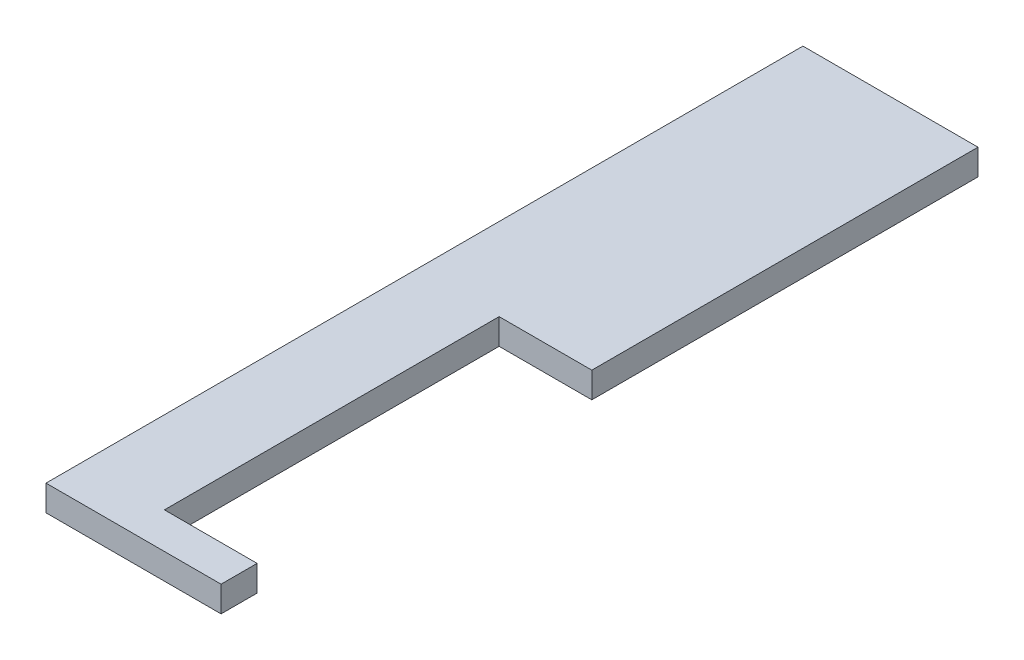
ISO-10303-21;
HEADER;
FILE_DESCRIPTION(('STEP AP214'),'2;1');
FILE_NAME('part.step','',(''),(''),'','','');
FILE_SCHEMA(('AUTOMOTIVE_DESIGN { 1 0 10303 214 1 1 1 1 }'));
ENDSEC;
DATA;
#1=APPLICATION_CONTEXT('core data for automotive mechanical design processes');
#2=APPLICATION_PROTOCOL_DEFINITION('international standard','automotive_design',2000,#1);
#3=PRODUCT_CONTEXT('',#1,'mechanical');
#4=PRODUCT('Part','Part','',(#3));
#5=PRODUCT_RELATED_PRODUCT_CATEGORY('part','',(#4));
#6=PRODUCT_DEFINITION_FORMATION('','',#4);
#7=PRODUCT_DEFINITION_CONTEXT('part definition',#1,'design');
#8=PRODUCT_DEFINITION('design','',#6,#7);
#9=PRODUCT_DEFINITION_SHAPE('','',#8);
#10=(LENGTH_UNIT() NAMED_UNIT(*) SI_UNIT(.MILLI.,.METRE.));
#11=(NAMED_UNIT(*) PLANE_ANGLE_UNIT() SI_UNIT($,.RADIAN.));
#12=(NAMED_UNIT(*) SI_UNIT($,.STERADIAN.) SOLID_ANGLE_UNIT());
#13=UNCERTAINTY_MEASURE_WITH_UNIT(LENGTH_MEASURE(1.E-05),#10,'distance_accuracy_value','');
#14=(GEOMETRIC_REPRESENTATION_CONTEXT(3) GLOBAL_UNCERTAINTY_ASSIGNED_CONTEXT((#13)) GLOBAL_UNIT_ASSIGNED_CONTEXT((#10,
#11,#12)) REPRESENTATION_CONTEXT('',''));
#15=CARTESIAN_POINT('',(0.,0.,0.));
#16=DIRECTION('',(0.,0.,1.));
#17=DIRECTION('',(1.,0.,0.));
#18=AXIS2_PLACEMENT_3D('',#15,#16,#17);
#19=CARTESIAN_POINT('',(0.,5.,147.));
#20=DIRECTION('',(0.,0.,-1.));
#21=DIRECTION('',(-1.,0.,0.));
#22=AXIS2_PLACEMENT_3D('',#19,#20,#21);
#23=PLANE('',#22);
#24=DIRECTION('',(1.,0.,0.));
#25=VECTOR('',#24,1.);
#26=CARTESIAN_POINT('',(0.,0.,147.));
#27=LINE('',#26,#25);
#28=CARTESIAN_POINT('',(0.,0.,147.));
#29=VERTEX_POINT('',#28);
#30=CARTESIAN_POINT('',(34.,0.,147.));
#31=VERTEX_POINT('',#30);
#32=EDGE_CURVE('E129',#29,#31,#27,.T.);
#33=ORIENTED_EDGE('',*,*,#32,.T.);
#34=DIRECTION('',(0.,-1.,0.));
#35=VECTOR('',#34,1.);
#36=CARTESIAN_POINT('',(34.,5.,147.));
#37=LINE('',#36,#35);
#38=CARTESIAN_POINT('',(34.,5.,147.));
#39=VERTEX_POINT('',#38);
#40=EDGE_CURVE('E11',#39,#31,#37,.T.);
#41=ORIENTED_EDGE('',*,*,#40,.F.);
#42=DIRECTION('',(1.,0.,0.));
#43=VECTOR('',#42,1.);
#44=CARTESIAN_POINT('',(0.,5.,147.));
#45=LINE('',#44,#43);
#46=CARTESIAN_POINT('',(0.,5.,147.));
#47=VERTEX_POINT('',#46);
#48=EDGE_CURVE('E143',#47,#39,#45,.T.);
#49=ORIENTED_EDGE('',*,*,#48,.F.);
#50=DIRECTION('',(0.,-1.,0.));
#51=VECTOR('',#50,1.);
#52=CARTESIAN_POINT('',(0.,5.,147.));
#53=LINE('',#52,#51);
#54=EDGE_CURVE('E125',#47,#29,#53,.T.);
#55=ORIENTED_EDGE('',*,*,#54,.T.);
#56=EDGE_LOOP('',(#33,#41,#49,#55));
#57=FACE_BOUND('',#56,.T.);
#58=ADVANCED_FACE('F33',(#57),#23,.F.);
#59=CARTESIAN_POINT('',(34.,5.,147.));
#60=DIRECTION('',(-1.,0.,0.));
#61=DIRECTION('',(0.,0.,1.));
#62=AXIS2_PLACEMENT_3D('',#59,#60,#61);
#63=PLANE('',#62);
#64=DIRECTION('',(0.,0.,-1.));
#65=VECTOR('',#64,1.);
#66=CARTESIAN_POINT('',(34.,0.,147.));
#67=LINE('',#66,#65);
#68=CARTESIAN_POINT('',(34.,0.,140.));
#69=VERTEX_POINT('',#68);
#70=EDGE_CURVE('E132',#31,#69,#67,.T.);
#71=ORIENTED_EDGE('',*,*,#70,.T.);
#72=DIRECTION('',(0.,-1.,0.));
#73=VECTOR('',#72,1.);
#74=CARTESIAN_POINT('',(34.,5.,140.));
#75=LINE('',#74,#73);
#76=CARTESIAN_POINT('',(34.,5.,140.));
#77=VERTEX_POINT('',#76);
#78=EDGE_CURVE('E41',#77,#69,#75,.T.);
#79=ORIENTED_EDGE('',*,*,#78,.F.);
#80=DIRECTION('',(0.,0.,-1.));
#81=VECTOR('',#80,1.);
#82=CARTESIAN_POINT('',(34.,5.,147.));
#83=LINE('',#82,#81);
#84=EDGE_CURVE('E92',#39,#77,#83,.T.);
#85=ORIENTED_EDGE('',*,*,#84,.F.);
#86=ORIENTED_EDGE('',*,*,#40,.T.);
#87=EDGE_LOOP('',(#71,#79,#85,#86));
#88=FACE_BOUND('',#87,.T.);
#89=ADVANCED_FACE('F178',(#88),#63,.F.);
#90=CARTESIAN_POINT('',(34.,5.,140.));
#91=DIRECTION('',(0.,0.,1.));
#92=DIRECTION('',(1.,0.,0.));
#93=AXIS2_PLACEMENT_3D('',#90,#91,#92);
#94=PLANE('',#93);
#95=DIRECTION('',(-1.,0.,0.));
#96=VECTOR('',#95,1.);
#97=CARTESIAN_POINT('',(34.,0.,140.));
#98=LINE('',#97,#96);
#99=CARTESIAN_POINT('',(16.,0.,140.));
#100=VERTEX_POINT('',#99);
#101=EDGE_CURVE('E134',#69,#100,#98,.T.);
#102=ORIENTED_EDGE('',*,*,#101,.T.);
#103=DIRECTION('',(0.,-1.,0.));
#104=VECTOR('',#103,1.);
#105=CARTESIAN_POINT('',(16.,5.,140.));
#106=LINE('',#105,#104);
#107=CARTESIAN_POINT('',(16.,5.,140.));
#108=VERTEX_POINT('',#107);
#109=EDGE_CURVE('E150',#108,#100,#106,.T.);
#110=ORIENTED_EDGE('',*,*,#109,.F.);
#111=DIRECTION('',(-1.,0.,0.));
#112=VECTOR('',#111,1.);
#113=CARTESIAN_POINT('',(34.,5.,140.));
#114=LINE('',#113,#112);
#115=EDGE_CURVE('E158',#77,#108,#114,.T.);
#116=ORIENTED_EDGE('',*,*,#115,.F.);
#117=ORIENTED_EDGE('',*,*,#78,.T.);
#118=EDGE_LOOP('',(#102,#110,#116,#117));
#119=FACE_BOUND('',#118,.T.);
#120=ADVANCED_FACE('F156',(#119),#94,.F.);
#121=CARTESIAN_POINT('',(16.,5.,140.));
#122=DIRECTION('',(-1.,0.,0.));
#123=DIRECTION('',(0.,0.,1.));
#124=AXIS2_PLACEMENT_3D('',#121,#122,#123);
#125=PLANE('',#124);
#126=DIRECTION('',(0.,0.,-1.));
#127=VECTOR('',#126,1.);
#128=CARTESIAN_POINT('',(16.,0.,140.));
#129=LINE('',#128,#127);
#130=CARTESIAN_POINT('',(16.,0.,75.));
#131=VERTEX_POINT('',#130);
#132=EDGE_CURVE('E136',#100,#131,#129,.T.);
#133=ORIENTED_EDGE('',*,*,#132,.T.);
#134=DIRECTION('',(0.,-1.,0.));
#135=VECTOR('',#134,1.);
#136=CARTESIAN_POINT('',(16.,5.,75.));
#137=LINE('',#136,#135);
#138=CARTESIAN_POINT('',(16.,5.,75.));
#139=VERTEX_POINT('',#138);
#140=EDGE_CURVE('E147',#139,#131,#137,.T.);
#141=ORIENTED_EDGE('',*,*,#140,.F.);
#142=DIRECTION('',(0.,0.,-1.));
#143=VECTOR('',#142,1.);
#144=CARTESIAN_POINT('',(16.,5.,140.));
#145=LINE('',#144,#143);
#146=EDGE_CURVE('E170',#108,#139,#145,.T.);
#147=ORIENTED_EDGE('',*,*,#146,.F.);
#148=ORIENTED_EDGE('',*,*,#109,.T.);
#149=EDGE_LOOP('',(#133,#141,#147,#148));
#150=FACE_BOUND('',#149,.T.);
#151=ADVANCED_FACE('F166',(#150),#125,.F.);
#152=CARTESIAN_POINT('',(16.,5.,75.));
#153=DIRECTION('',(0.,0.,-1.));
#154=DIRECTION('',(-1.,0.,0.));
#155=AXIS2_PLACEMENT_3D('',#152,#153,#154);
#156=PLANE('',#155);
#157=DIRECTION('',(1.,0.,0.));
#158=VECTOR('',#157,1.);
#159=CARTESIAN_POINT('',(16.,0.,75.));
#160=LINE('',#159,#158);
#161=CARTESIAN_POINT('',(34.,0.,75.));
#162=VERTEX_POINT('',#161);
#163=EDGE_CURVE('E138',#131,#162,#160,.T.);
#164=ORIENTED_EDGE('',*,*,#163,.T.);
#165=DIRECTION('',(0.,-1.,0.));
#166=VECTOR('',#165,1.);
#167=CARTESIAN_POINT('',(34.,5.,75.));
#168=LINE('',#167,#166);
#169=CARTESIAN_POINT('',(34.,5.,75.));
#170=VERTEX_POINT('',#169);
#171=EDGE_CURVE('E120',#170,#162,#168,.T.);
#172=ORIENTED_EDGE('',*,*,#171,.F.);
#173=DIRECTION('',(1.,0.,0.));
#174=VECTOR('',#173,1.);
#175=CARTESIAN_POINT('',(16.,5.,75.));
#176=LINE('',#175,#174);
#177=EDGE_CURVE('E111',#139,#170,#176,.T.);
#178=ORIENTED_EDGE('',*,*,#177,.F.);
#179=ORIENTED_EDGE('',*,*,#140,.T.);
#180=EDGE_LOOP('',(#164,#172,#178,#179));
#181=FACE_BOUND('',#180,.T.);
#182=ADVANCED_FACE('F169',(#181),#156,.F.);
#183=CARTESIAN_POINT('',(34.,5.,0.));
#184=DIRECTION('',(-1.,0.,0.));
#185=DIRECTION('',(0.,0.,1.));
#186=AXIS2_PLACEMENT_3D('',#183,#184,#185);
#187=PLANE('',#186);
#188=DIRECTION('',(0.,0.,-1.));
#189=VECTOR('',#188,1.);
#190=CARTESIAN_POINT('',(34.,0.,0.));
#191=LINE('',#190,#189);
#192=CARTESIAN_POINT('',(34.,0.,0.));
#193=VERTEX_POINT('',#192);
#194=EDGE_CURVE('E119',#162,#193,#191,.T.);
#195=ORIENTED_EDGE('',*,*,#194,.T.);
#196=DIRECTION('',(0.,-1.,0.));
#197=VECTOR('',#196,1.);
#198=CARTESIAN_POINT('',(34.,5.,0.));
#199=LINE('',#198,#197);
#200=CARTESIAN_POINT('',(34.,5.,0.));
#201=VERTEX_POINT('',#200);
#202=EDGE_CURVE('E116',#201,#193,#199,.T.);
#203=ORIENTED_EDGE('',*,*,#202,.F.);
#204=DIRECTION('',(0.,0.,-1.));
#205=VECTOR('',#204,1.);
#206=CARTESIAN_POINT('',(34.,5.,0.));
#207=LINE('',#206,#205);
#208=EDGE_CURVE('E105',#170,#201,#207,.T.);
#209=ORIENTED_EDGE('',*,*,#208,.F.);
#210=ORIENTED_EDGE('',*,*,#171,.T.);
#211=EDGE_LOOP('',(#195,#203,#209,#210));
#212=FACE_BOUND('',#211,.T.);
#213=ADVANCED_FACE('F117',(#212),#187,.F.);
#214=CARTESIAN_POINT('',(34.,5.,0.));
#215=DIRECTION('',(0.,0.,1.));
#216=DIRECTION('',(1.,0.,0.));
#217=AXIS2_PLACEMENT_3D('',#214,#215,#216);
#218=PLANE('',#217);
#219=DIRECTION('',(-1.,0.,0.));
#220=VECTOR('',#219,1.);
#221=CARTESIAN_POINT('',(34.,0.,0.));
#222=LINE('',#221,#220);
#223=CARTESIAN_POINT('',(0.,0.,0.));
#224=VERTEX_POINT('',#223);
#225=EDGE_CURVE('E78',#193,#224,#222,.T.);
#226=ORIENTED_EDGE('',*,*,#225,.T.);
#227=DIRECTION('',(0.,-1.,0.));
#228=VECTOR('',#227,1.);
#229=CARTESIAN_POINT('',(0.,5.,0.));
#230=LINE('',#229,#228);
#231=CARTESIAN_POINT('',(0.,5.,0.));
#232=VERTEX_POINT('',#231);
#233=EDGE_CURVE('E121',#232,#224,#230,.T.);
#234=ORIENTED_EDGE('',*,*,#233,.F.);
#235=DIRECTION('',(-1.,0.,0.));
#236=VECTOR('',#235,1.);
#237=CARTESIAN_POINT('',(34.,5.,0.));
#238=LINE('',#237,#236);
#239=EDGE_CURVE('E109',#201,#232,#238,.T.);
#240=ORIENTED_EDGE('',*,*,#239,.F.);
#241=ORIENTED_EDGE('',*,*,#202,.T.);
#242=EDGE_LOOP('',(#226,#234,#240,#241));
#243=FACE_BOUND('',#242,.T.);
#244=ADVANCED_FACE('F123',(#243),#218,.F.);
#245=CARTESIAN_POINT('',(0.,5.,0.));
#246=DIRECTION('',(1.,0.,0.));
#247=DIRECTION('',(0.,0.,-1.));
#248=AXIS2_PLACEMENT_3D('',#245,#246,#247);
#249=PLANE('',#248);
#250=DIRECTION('',(0.,0.,1.));
#251=VECTOR('',#250,1.);
#252=CARTESIAN_POINT('',(0.,0.,0.));
#253=LINE('',#252,#251);
#254=EDGE_CURVE('E84',#224,#29,#253,.T.);
#255=ORIENTED_EDGE('',*,*,#254,.T.);
#256=ORIENTED_EDGE('',*,*,#54,.F.);
#257=DIRECTION('',(0.,0.,1.));
#258=VECTOR('',#257,1.);
#259=CARTESIAN_POINT('',(0.,5.,0.));
#260=LINE('',#259,#258);
#261=EDGE_CURVE('E49',#232,#47,#260,.T.);
#262=ORIENTED_EDGE('',*,*,#261,.F.);
#263=ORIENTED_EDGE('',*,*,#233,.T.);
#264=EDGE_LOOP('',(#255,#256,#262,#263));
#265=FACE_BOUND('',#264,.T.);
#266=ADVANCED_FACE('F194',(#265),#249,.F.);
#267=CARTESIAN_POINT('',(0.,5.,0.));
#268=DIRECTION('',(0.,1.,0.));
#269=DIRECTION('',(0.,0.,1.));
#270=AXIS2_PLACEMENT_3D('',#267,#268,#269);
#271=PLANE('',#270);
#272=ORIENTED_EDGE('',*,*,#48,.T.);
#273=ORIENTED_EDGE('',*,*,#84,.T.);
#274=ORIENTED_EDGE('',*,*,#115,.T.);
#275=ORIENTED_EDGE('',*,*,#146,.T.);
#276=ORIENTED_EDGE('',*,*,#177,.T.);
#277=ORIENTED_EDGE('',*,*,#208,.T.);
#278=ORIENTED_EDGE('',*,*,#239,.T.);
#279=ORIENTED_EDGE('',*,*,#261,.T.);
#280=EDGE_LOOP('',(#272,#273,#274,#275,#276,#277,#278,#279));
#281=FACE_BOUND('',#280,.T.);
#282=ADVANCED_FACE('F107',(#281),#271,.T.);
#283=CARTESIAN_POINT('',(0.,0.,0.));
#284=DIRECTION('',(0.,1.,0.));
#285=DIRECTION('',(0.,0.,1.));
#286=AXIS2_PLACEMENT_3D('',#283,#284,#285);
#287=PLANE('',#286);
#288=ORIENTED_EDGE('',*,*,#32,.F.);
#289=ORIENTED_EDGE('',*,*,#254,.F.);
#290=ORIENTED_EDGE('',*,*,#225,.F.);
#291=ORIENTED_EDGE('',*,*,#194,.F.);
#292=ORIENTED_EDGE('',*,*,#163,.F.);
#293=ORIENTED_EDGE('',*,*,#132,.F.);
#294=ORIENTED_EDGE('',*,*,#101,.F.);
#295=ORIENTED_EDGE('',*,*,#70,.F.);
#296=EDGE_LOOP('',(#288,#289,#290,#291,#292,#293,#294,#295));
#297=FACE_BOUND('',#296,.T.);
#298=ADVANCED_FACE('F162',(#297),#287,.F.);
#299=CLOSED_SHELL('',(#58,#89,#120,#151,#182,#213,#244,#266,#282,#298));
#300=MANIFOLD_SOLID_BREP('B2',#299);
#301=ADVANCED_BREP_SHAPE_REPRESENTATION('',(#18,#300),#14);
#302=SHAPE_DEFINITION_REPRESENTATION(#9,#301);
ENDSEC;
END-ISO-10303-21;
